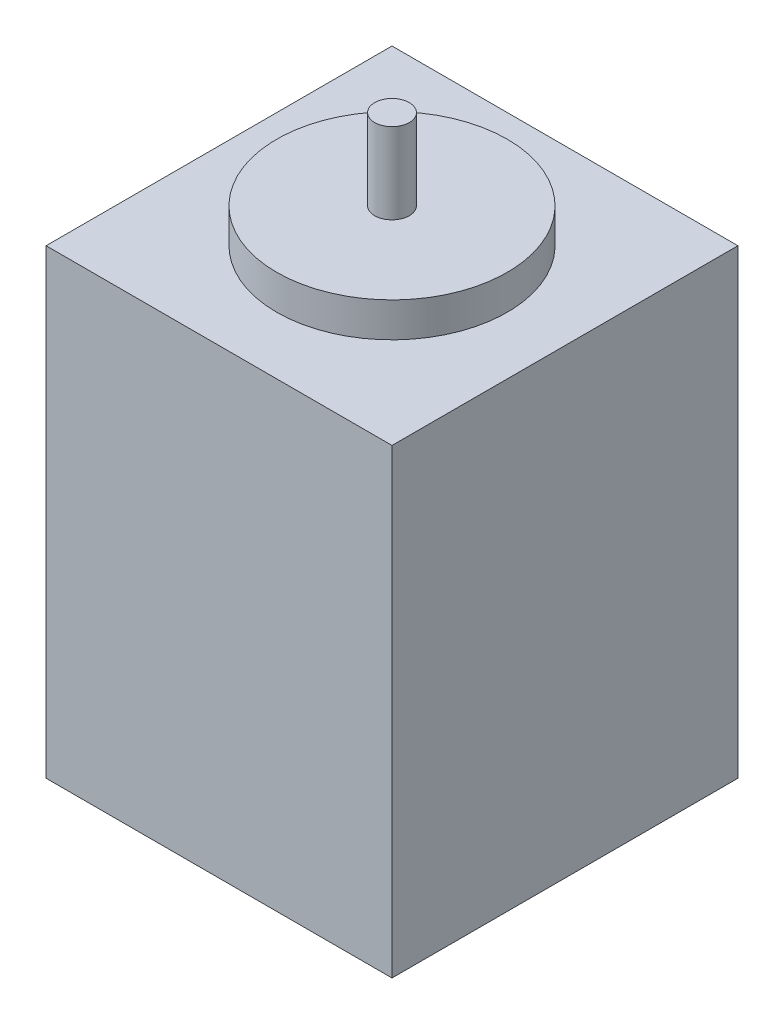
ISO-10303-21;
HEADER;
FILE_DESCRIPTION(('STEP AP214'),'2;1');
FILE_NAME('part.step','',(''),(''),'','','');
FILE_SCHEMA(('AUTOMOTIVE_DESIGN { 1 0 10303 214 1 1 1 1 }'));
ENDSEC;
DATA;
#1=APPLICATION_CONTEXT('core data for automotive mechanical design processes');
#2=APPLICATION_PROTOCOL_DEFINITION('international standard','automotive_design',2000,#1);
#3=PRODUCT_CONTEXT('',#1,'mechanical');
#4=PRODUCT('Part','Part','',(#3));
#5=PRODUCT_RELATED_PRODUCT_CATEGORY('part','',(#4));
#6=PRODUCT_DEFINITION_FORMATION('','',#4);
#7=PRODUCT_DEFINITION_CONTEXT('part definition',#1,'design');
#8=PRODUCT_DEFINITION('design','',#6,#7);
#9=PRODUCT_DEFINITION_SHAPE('','',#8);
#10=(LENGTH_UNIT() NAMED_UNIT(*) SI_UNIT(.MILLI.,.METRE.));
#11=(NAMED_UNIT(*) PLANE_ANGLE_UNIT() SI_UNIT($,.RADIAN.));
#12=(NAMED_UNIT(*) SI_UNIT($,.STERADIAN.) SOLID_ANGLE_UNIT());
#13=UNCERTAINTY_MEASURE_WITH_UNIT(LENGTH_MEASURE(1.E-05),#10,'distance_accuracy_value','');
#14=(GEOMETRIC_REPRESENTATION_CONTEXT(3) GLOBAL_UNCERTAINTY_ASSIGNED_CONTEXT((#13)) GLOBAL_UNIT_ASSIGNED_CONTEXT((#10,
#11,#12)) REPRESENTATION_CONTEXT('',''));
#15=CARTESIAN_POINT('',(0.,0.,0.));
#16=DIRECTION('',(0.,0.,1.));
#17=DIRECTION('',(1.,0.,0.));
#18=AXIS2_PLACEMENT_3D('',#15,#16,#17);
#19=CARTESIAN_POINT('',(0.,40.,-30.));
#20=DIRECTION('',(0.,-1.,0.));
#21=DIRECTION('',(0.,0.,-1.));
#22=AXIS2_PLACEMENT_3D('',#19,#20,#21);
#23=PLANE('',#22);
#24=DIRECTION('',(0.,0.,1.));
#25=VECTOR('',#24,1.);
#26=CARTESIAN_POINT('',(0.,40.,0.));
#27=LINE('',#26,#25);
#28=CARTESIAN_POINT('',(0.,40.,-30.));
#29=VERTEX_POINT('',#28);
#30=CARTESIAN_POINT('',(0.,40.,0.));
#31=VERTEX_POINT('',#30);
#32=EDGE_CURVE('E84',#29,#31,#27,.T.);
#33=ORIENTED_EDGE('',*,*,#32,.T.);
#34=DIRECTION('',(1.,0.,0.));
#35=VECTOR('',#34,1.);
#36=CARTESIAN_POINT('',(0.,40.,0.));
#37=LINE('',#36,#35);
#38=CARTESIAN_POINT('',(30.,40.,0.));
#39=VERTEX_POINT('',#38);
#40=EDGE_CURVE('E79',#31,#39,#37,.T.);
#41=ORIENTED_EDGE('',*,*,#40,.T.);
#42=DIRECTION('',(0.,0.,-1.));
#43=VECTOR('',#42,1.);
#44=CARTESIAN_POINT('',(30.,40.,0.));
#45=LINE('',#44,#43);
#46=CARTESIAN_POINT('',(30.,40.,-30.));
#47=VERTEX_POINT('',#46);
#48=EDGE_CURVE('E82',#39,#47,#45,.T.);
#49=ORIENTED_EDGE('',*,*,#48,.T.);
#50=DIRECTION('',(-1.,0.,0.));
#51=VECTOR('',#50,1.);
#52=CARTESIAN_POINT('',(0.,40.,-30.));
#53=LINE('',#52,#51);
#54=EDGE_CURVE('E48',#47,#29,#53,.T.);
#55=ORIENTED_EDGE('',*,*,#54,.T.);
#56=EDGE_LOOP('',(#33,#41,#49,#55));
#57=FACE_BOUND('',#56,.T.);
#58=CARTESIAN_POINT('',(15.,40.,-15.));
#59=DIRECTION('',(0.,-1.,0.));
#60=DIRECTION('',(0.,0.,-1.));
#61=AXIS2_PLACEMENT_3D('',#58,#59,#60);
#62=CIRCLE('',#61,10.);
#63=CARTESIAN_POINT('',(15.,40.,-25.));
#64=VERTEX_POINT('',#63);
#65=EDGE_CURVE('E11',#64,#64,#62,.F.);
#66=ORIENTED_EDGE('',*,*,#65,.F.);
#67=EDGE_LOOP('',(#66));
#68=FACE_BOUND('',#67,.T.);
#69=ADVANCED_FACE('F31',(#57,#68),#23,.F.);
#70=CARTESIAN_POINT('',(0.,40.,0.));
#71=DIRECTION('',(1.,0.,0.));
#72=DIRECTION('',(0.,0.,-1.));
#73=AXIS2_PLACEMENT_3D('',#70,#71,#72);
#74=PLANE('',#73);
#75=DIRECTION('',(0.,0.,1.));
#76=VECTOR('',#75,1.);
#77=CARTESIAN_POINT('',(0.,0.,0.));
#78=LINE('',#77,#76);
#79=CARTESIAN_POINT('',(0.,0.,-30.));
#80=VERTEX_POINT('',#79);
#81=CARTESIAN_POINT('',(0.,0.,0.));
#82=VERTEX_POINT('',#81);
#83=EDGE_CURVE('E98',#80,#82,#78,.T.);
#84=ORIENTED_EDGE('',*,*,#83,.T.);
#85=DIRECTION('',(0.,-1.,0.));
#86=VECTOR('',#85,1.);
#87=CARTESIAN_POINT('',(0.,40.,0.));
#88=LINE('',#87,#86);
#89=EDGE_CURVE('E40',#31,#82,#88,.T.);
#90=ORIENTED_EDGE('',*,*,#89,.F.);
#91=ORIENTED_EDGE('',*,*,#32,.F.);
#92=DIRECTION('',(0.,-1.,0.));
#93=VECTOR('',#92,1.);
#94=CARTESIAN_POINT('',(0.,40.,-30.));
#95=LINE('',#94,#93);
#96=EDGE_CURVE('E94',#29,#80,#95,.T.);
#97=ORIENTED_EDGE('',*,*,#96,.T.);
#98=EDGE_LOOP('',(#84,#90,#91,#97));
#99=FACE_BOUND('',#98,.T.);
#100=ADVANCED_FACE('F33',(#99),#74,.F.);
#101=CARTESIAN_POINT('',(0.,40.,0.));
#102=DIRECTION('',(0.,0.,-1.));
#103=DIRECTION('',(-1.,0.,0.));
#104=AXIS2_PLACEMENT_3D('',#101,#102,#103);
#105=PLANE('',#104);
#106=DIRECTION('',(1.,0.,0.));
#107=VECTOR('',#106,1.);
#108=CARTESIAN_POINT('',(0.,0.,0.));
#109=LINE('',#108,#107);
#110=CARTESIAN_POINT('',(30.,0.,0.));
#111=VERTEX_POINT('',#110);
#112=EDGE_CURVE('E89',#82,#111,#109,.T.);
#113=ORIENTED_EDGE('',*,*,#112,.T.);
#114=DIRECTION('',(0.,-1.,0.));
#115=VECTOR('',#114,1.);
#116=CARTESIAN_POINT('',(30.,40.,0.));
#117=LINE('',#116,#115);
#118=EDGE_CURVE('E87',#39,#111,#117,.T.);
#119=ORIENTED_EDGE('',*,*,#118,.F.);
#120=ORIENTED_EDGE('',*,*,#40,.F.);
#121=ORIENTED_EDGE('',*,*,#89,.T.);
#122=EDGE_LOOP('',(#113,#119,#120,#121));
#123=FACE_BOUND('',#122,.T.);
#124=ADVANCED_FACE('F88',(#123),#105,.F.);
#125=CARTESIAN_POINT('',(30.,40.,0.));
#126=DIRECTION('',(-1.,0.,0.));
#127=DIRECTION('',(0.,0.,1.));
#128=AXIS2_PLACEMENT_3D('',#125,#126,#127);
#129=PLANE('',#128);
#130=DIRECTION('',(0.,0.,-1.));
#131=VECTOR('',#130,1.);
#132=CARTESIAN_POINT('',(30.,0.,0.));
#133=LINE('',#132,#131);
#134=CARTESIAN_POINT('',(30.,0.,-30.));
#135=VERTEX_POINT('',#134);
#136=EDGE_CURVE('E65',#111,#135,#133,.T.);
#137=ORIENTED_EDGE('',*,*,#136,.T.);
#138=DIRECTION('',(0.,-1.,0.));
#139=VECTOR('',#138,1.);
#140=CARTESIAN_POINT('',(30.,40.,-30.));
#141=LINE('',#140,#139);
#142=EDGE_CURVE('E90',#47,#135,#141,.T.);
#143=ORIENTED_EDGE('',*,*,#142,.F.);
#144=ORIENTED_EDGE('',*,*,#48,.F.);
#145=ORIENTED_EDGE('',*,*,#118,.T.);
#146=EDGE_LOOP('',(#137,#143,#144,#145));
#147=FACE_BOUND('',#146,.T.);
#148=ADVANCED_FACE('F92',(#147),#129,.F.);
#149=CARTESIAN_POINT('',(0.,40.,-30.));
#150=DIRECTION('',(0.,0.,1.));
#151=DIRECTION('',(1.,0.,0.));
#152=AXIS2_PLACEMENT_3D('',#149,#150,#151);
#153=PLANE('',#152);
#154=DIRECTION('',(-1.,0.,0.));
#155=VECTOR('',#154,1.);
#156=CARTESIAN_POINT('',(0.,0.,-30.));
#157=LINE('',#156,#155);
#158=EDGE_CURVE('E71',#135,#80,#157,.T.);
#159=ORIENTED_EDGE('',*,*,#158,.T.);
#160=ORIENTED_EDGE('',*,*,#96,.F.);
#161=ORIENTED_EDGE('',*,*,#54,.F.);
#162=ORIENTED_EDGE('',*,*,#142,.T.);
#163=EDGE_LOOP('',(#159,#160,#161,#162));
#164=FACE_BOUND('',#163,.T.);
#165=ADVANCED_FACE('F140',(#164),#153,.F.);
#166=CARTESIAN_POINT('',(0.,0.,-30.));
#167=DIRECTION('',(0.,-1.,0.));
#168=DIRECTION('',(0.,0.,-1.));
#169=AXIS2_PLACEMENT_3D('',#166,#167,#168);
#170=PLANE('',#169);
#171=ORIENTED_EDGE('',*,*,#83,.F.);
#172=ORIENTED_EDGE('',*,*,#158,.F.);
#173=ORIENTED_EDGE('',*,*,#136,.F.);
#174=ORIENTED_EDGE('',*,*,#112,.F.);
#175=EDGE_LOOP('',(#171,#172,#173,#174));
#176=FACE_BOUND('',#175,.T.);
#177=ADVANCED_FACE('F137',(#176),#170,.T.);
#178=CARTESIAN_POINT('',(15.,43.,-15.));
#179=DIRECTION('',(0.,1.,0.));
#180=DIRECTION('',(0.,0.,1.));
#181=AXIS2_PLACEMENT_3D('',#178,#179,#180);
#182=PLANE('',#181);
#183=CARTESIAN_POINT('',(15.,43.,-15.));
#184=DIRECTION('',(0.,1.,0.));
#185=DIRECTION('',(0.,0.,1.));
#186=AXIS2_PLACEMENT_3D('',#183,#184,#185);
#187=CIRCLE('',#186,10.);
#188=CARTESIAN_POINT('',(15.,43.,-5.));
#189=VERTEX_POINT('',#188);
#190=EDGE_CURVE('E109',#189,#189,#187,.T.);
#191=ORIENTED_EDGE('',*,*,#190,.T.);
#192=EDGE_LOOP('',(#191));
#193=FACE_BOUND('',#192,.T.);
#194=CARTESIAN_POINT('',(15.,43.,-15.));
#195=DIRECTION('',(0.,1.,0.));
#196=DIRECTION('',(0.,0.,1.));
#197=AXIS2_PLACEMENT_3D('',#194,#195,#196);
#198=CIRCLE('',#197,1.5);
#199=CARTESIAN_POINT('',(15.,43.,-13.5));
#200=VERTEX_POINT('',#199);
#201=EDGE_CURVE('E107',#200,#200,#198,.T.);
#202=ORIENTED_EDGE('',*,*,#201,.F.);
#203=EDGE_LOOP('',(#202));
#204=FACE_BOUND('',#203,.T.);
#205=ADVANCED_FACE('F118',(#193,#204),#182,.T.);
#206=CARTESIAN_POINT('',(15.,43.,-15.));
#207=DIRECTION('',(0.,-1.,0.));
#208=DIRECTION('',(0.,0.,-1.));
#209=AXIS2_PLACEMENT_3D('',#206,#207,#208);
#210=CYLINDRICAL_SURFACE('',#209,10.);
#211=ORIENTED_EDGE('',*,*,#190,.F.);
#212=EDGE_LOOP('',(#211));
#213=FACE_BOUND('',#212,.T.);
#214=ORIENTED_EDGE('',*,*,#65,.T.);
#215=EDGE_LOOP('',(#214));
#216=FACE_BOUND('',#215,.T.);
#217=ADVANCED_FACE('F121',(#213,#216),#210,.T.);
#218=CARTESIAN_POINT('',(15.,50.,-15.));
#219=DIRECTION('',(0.,1.,0.));
#220=DIRECTION('',(0.,0.,1.));
#221=AXIS2_PLACEMENT_3D('',#218,#219,#220);
#222=PLANE('',#221);
#223=CARTESIAN_POINT('',(15.,50.,-15.));
#224=DIRECTION('',(0.,1.,0.));
#225=DIRECTION('',(0.,0.,1.));
#226=AXIS2_PLACEMENT_3D('',#223,#224,#225);
#227=CIRCLE('',#226,1.5);
#228=CARTESIAN_POINT('',(15.,50.,-13.5));
#229=VERTEX_POINT('',#228);
#230=EDGE_CURVE('E101',#229,#229,#227,.T.);
#231=ORIENTED_EDGE('',*,*,#230,.T.);
#232=EDGE_LOOP('',(#231));
#233=FACE_BOUND('',#232,.T.);
#234=ADVANCED_FACE('F124',(#233),#222,.T.);
#235=CARTESIAN_POINT('',(15.,50.,-15.));
#236=DIRECTION('',(0.,-1.,0.));
#237=DIRECTION('',(0.,0.,-1.));
#238=AXIS2_PLACEMENT_3D('',#235,#236,#237);
#239=CYLINDRICAL_SURFACE('',#238,1.5);
#240=ORIENTED_EDGE('',*,*,#201,.T.);
#241=EDGE_LOOP('',(#240));
#242=FACE_BOUND('',#241,.T.);
#243=ORIENTED_EDGE('',*,*,#230,.F.);
#244=EDGE_LOOP('',(#243));
#245=FACE_BOUND('',#244,.T.);
#246=ADVANCED_FACE('F135',(#242,#245),#239,.T.);
#247=CLOSED_SHELL('',(#69,#100,#124,#148,#165,#177,#205,#217,#234,#246));
#248=MANIFOLD_SOLID_BREP('B2',#247);
#249=ADVANCED_BREP_SHAPE_REPRESENTATION('',(#18,#248),#14);
#250=SHAPE_DEFINITION_REPRESENTATION(#9,#249);
ENDSEC;
END-ISO-10303-21;
